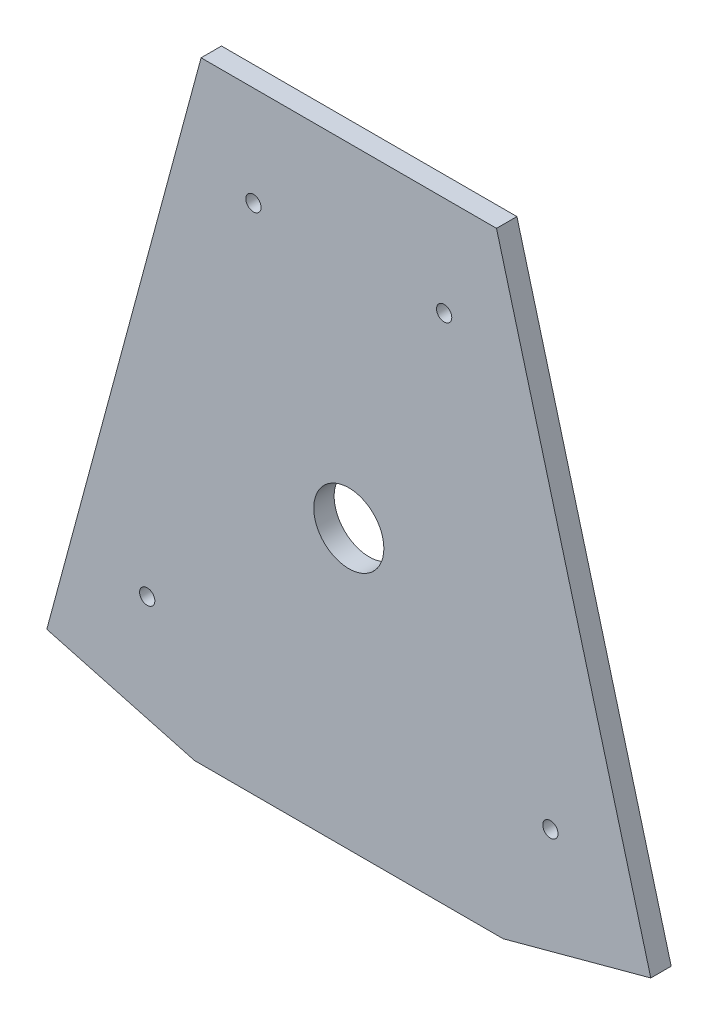
ISO-10303-21;
HEADER;
FILE_DESCRIPTION(('STEP AP214'),'2;1');
FILE_NAME('part.step','',(''),(''),'','','');
FILE_SCHEMA(('AUTOMOTIVE_DESIGN { 1 0 10303 214 1 1 1 1 }'));
ENDSEC;
DATA;
#1=APPLICATION_CONTEXT('core data for automotive mechanical design processes');
#2=APPLICATION_PROTOCOL_DEFINITION('international standard','automotive_design',2000,#1);
#3=PRODUCT_CONTEXT('',#1,'mechanical');
#4=PRODUCT('Part','Part','',(#3));
#5=PRODUCT_RELATED_PRODUCT_CATEGORY('part','',(#4));
#6=PRODUCT_DEFINITION_FORMATION('','',#4);
#7=PRODUCT_DEFINITION_CONTEXT('part definition',#1,'design');
#8=PRODUCT_DEFINITION('design','',#6,#7);
#9=PRODUCT_DEFINITION_SHAPE('','',#8);
#10=(LENGTH_UNIT() NAMED_UNIT(*) SI_UNIT(.MILLI.,.METRE.));
#11=(NAMED_UNIT(*) PLANE_ANGLE_UNIT() SI_UNIT($,.RADIAN.));
#12=(NAMED_UNIT(*) SI_UNIT($,.STERADIAN.) SOLID_ANGLE_UNIT());
#13=UNCERTAINTY_MEASURE_WITH_UNIT(LENGTH_MEASURE(1.E-05),#10,'distance_accuracy_value','');
#14=(GEOMETRIC_REPRESENTATION_CONTEXT(3) GLOBAL_UNCERTAINTY_ASSIGNED_CONTEXT((#13)) GLOBAL_UNIT_ASSIGNED_CONTEXT((#10,
#11,#12)) REPRESENTATION_CONTEXT('',''));
#15=CARTESIAN_POINT('',(0.,0.,0.));
#16=DIRECTION('',(0.,0.,1.));
#17=DIRECTION('',(1.,0.,0.));
#18=AXIS2_PLACEMENT_3D('',#15,#16,#17);
#19=CARTESIAN_POINT('',(-75.212399068759,-132.55771764791,5.08));
#20=DIRECTION('',(0.965501522964468,-0.260397406195401,0.));
#21=DIRECTION('',(0.260397406195401,0.965501522964468,0.));
#22=AXIS2_PLACEMENT_3D('',#19,#20,#21);
#23=PLANE('',#22);
#24=DIRECTION('',(-0.260397406195401,-0.965501522964468,0.));
#25=VECTOR('',#24,1.);
#26=CARTESIAN_POINT('',(-75.212399068759,-132.55771764791,0.));
#27=LINE('',#26,#25);
#28=CARTESIAN_POINT('',(-36.7856080249462,9.92114117604477,0.));
#29=VERTEX_POINT('',#28);
#30=CARTESIAN_POINT('',(-75.212399068759,-132.55771764791,0.));
#31=VERTEX_POINT('',#30);
#32=EDGE_CURVE('E118',#29,#31,#27,.T.);
#33=ORIENTED_EDGE('',*,*,#32,.T.);
#34=DIRECTION('',(0.,0.,-1.));
#35=VECTOR('',#34,1.);
#36=CARTESIAN_POINT('',(-75.212399068759,-132.55771764791,5.08));
#37=LINE('',#36,#35);
#38=CARTESIAN_POINT('',(-75.212399068759,-132.55771764791,5.08));
#39=VERTEX_POINT('',#38);
#40=EDGE_CURVE('E11',#39,#31,#37,.T.);
#41=ORIENTED_EDGE('',*,*,#40,.F.);
#42=DIRECTION('',(-0.260397406195401,-0.965501522964468,0.));
#43=VECTOR('',#42,1.);
#44=CARTESIAN_POINT('',(-75.212399068759,-132.55771764791,5.08));
#45=LINE('',#44,#43);
#46=CARTESIAN_POINT('',(-36.7856080249462,9.92114117604477,5.08));
#47=VERTEX_POINT('',#46);
#48=EDGE_CURVE('E129',#47,#39,#45,.T.);
#49=ORIENTED_EDGE('',*,*,#48,.F.);
#50=DIRECTION('',(0.,0.,-1.));
#51=VECTOR('',#50,1.);
#52=CARTESIAN_POINT('',(-36.7856080249462,9.92114117604477,5.08));
#53=LINE('',#52,#51);
#54=EDGE_CURVE('E114',#47,#29,#53,.T.);
#55=ORIENTED_EDGE('',*,*,#54,.T.);
#56=EDGE_LOOP('',(#33,#41,#49,#55));
#57=FACE_BOUND('',#56,.T.);
#58=ADVANCED_FACE('F33',(#57),#23,.F.);
#59=CARTESIAN_POINT('',(-38.4267910438128,-142.478858823955,5.08));
#60=DIRECTION('',(0.260397406195401,0.965501522964468,0.));
#61=DIRECTION('',(-0.965501522964468,0.260397406195401,0.));
#62=AXIS2_PLACEMENT_3D('',#59,#60,#61);
#63=PLANE('',#62);
#64=DIRECTION('',(0.965501522964468,-0.260397406195401,0.));
#65=VECTOR('',#64,1.);
#66=CARTESIAN_POINT('',(-38.4267910438128,-142.478858823955,0.));
#67=LINE('',#66,#65);
#68=CARTESIAN_POINT('',(-38.4267910438128,-142.478858823955,0.));
#69=VERTEX_POINT('',#68);
#70=EDGE_CURVE('E121',#31,#69,#67,.T.);
#71=ORIENTED_EDGE('',*,*,#70,.T.);
#72=DIRECTION('',(0.,0.,-1.));
#73=VECTOR('',#72,1.);
#74=CARTESIAN_POINT('',(-38.4267910438128,-142.478858823955,5.08));
#75=LINE('',#74,#73);
#76=CARTESIAN_POINT('',(-38.4267910438128,-142.478858823955,5.08));
#77=VERTEX_POINT('',#76);
#78=EDGE_CURVE('E41',#77,#69,#75,.T.);
#79=ORIENTED_EDGE('',*,*,#78,.F.);
#80=DIRECTION('',(0.965501522964468,-0.260397406195401,0.));
#81=VECTOR('',#80,1.);
#82=CARTESIAN_POINT('',(-38.4267910438128,-142.478858823955,5.08));
#83=LINE('',#82,#81);
#84=EDGE_CURVE('E86',#39,#77,#83,.T.);
#85=ORIENTED_EDGE('',*,*,#84,.F.);
#86=ORIENTED_EDGE('',*,*,#40,.T.);
#87=EDGE_LOOP('',(#71,#79,#85,#86));
#88=FACE_BOUND('',#87,.T.);
#89=ADVANCED_FACE('F155',(#88),#63,.F.);
#90=CARTESIAN_POINT('',(38.4267910438129,-142.478858823955,5.08));
#91=DIRECTION('',(0.,1.,0.));
#92=DIRECTION('',(-1.,0.,0.));
#93=AXIS2_PLACEMENT_3D('',#90,#91,#92);
#94=PLANE('',#93);
#95=DIRECTION('',(1.,0.,0.));
#96=VECTOR('',#95,1.);
#97=CARTESIAN_POINT('',(38.4267910438129,-142.478858823955,0.));
#98=LINE('',#97,#96);
#99=CARTESIAN_POINT('',(38.4267910438129,-142.478858823955,0.));
#100=VERTEX_POINT('',#99);
#101=EDGE_CURVE('E124',#69,#100,#98,.T.);
#102=ORIENTED_EDGE('',*,*,#101,.T.);
#103=DIRECTION('',(0.,0.,-1.));
#104=VECTOR('',#103,1.);
#105=CARTESIAN_POINT('',(38.4267910438129,-142.478858823955,5.08));
#106=LINE('',#105,#104);
#107=CARTESIAN_POINT('',(38.4267910438129,-142.478858823955,5.08));
#108=VERTEX_POINT('',#107);
#109=EDGE_CURVE('E109',#108,#100,#106,.T.);
#110=ORIENTED_EDGE('',*,*,#109,.F.);
#111=DIRECTION('',(1.,0.,0.));
#112=VECTOR('',#111,1.);
#113=CARTESIAN_POINT('',(38.4267910438129,-142.478858823955,5.08));
#114=LINE('',#113,#112);
#115=EDGE_CURVE('E100',#77,#108,#114,.T.);
#116=ORIENTED_EDGE('',*,*,#115,.F.);
#117=ORIENTED_EDGE('',*,*,#78,.T.);
#118=EDGE_LOOP('',(#102,#110,#116,#117));
#119=FACE_BOUND('',#118,.T.);
#120=ADVANCED_FACE('F135',(#119),#94,.F.);
#121=CARTESIAN_POINT('',(75.2123990687591,-132.55771764791,5.08));
#122=DIRECTION('',(-0.260397406195401,0.965501522964468,0.));
#123=DIRECTION('',(-0.965501522964468,-0.260397406195401,0.));
#124=AXIS2_PLACEMENT_3D('',#121,#122,#123);
#125=PLANE('',#124);
#126=DIRECTION('',(0.965501522964468,0.260397406195401,0.));
#127=VECTOR('',#126,1.);
#128=CARTESIAN_POINT('',(75.2123990687591,-132.55771764791,0.));
#129=LINE('',#128,#127);
#130=CARTESIAN_POINT('',(75.2123990687591,-132.55771764791,0.));
#131=VERTEX_POINT('',#130);
#132=EDGE_CURVE('E108',#100,#131,#129,.T.);
#133=ORIENTED_EDGE('',*,*,#132,.T.);
#134=DIRECTION('',(0.,0.,-1.));
#135=VECTOR('',#134,1.);
#136=CARTESIAN_POINT('',(75.2123990687591,-132.55771764791,5.08));
#137=LINE('',#136,#135);
#138=CARTESIAN_POINT('',(75.2123990687591,-132.55771764791,5.08));
#139=VERTEX_POINT('',#138);
#140=EDGE_CURVE('E105',#139,#131,#137,.T.);
#141=ORIENTED_EDGE('',*,*,#140,.F.);
#142=DIRECTION('',(0.965501522964468,0.260397406195401,0.));
#143=VECTOR('',#142,1.);
#144=CARTESIAN_POINT('',(75.2123990687591,-132.55771764791,5.08));
#145=LINE('',#144,#143);
#146=EDGE_CURVE('E93',#108,#139,#145,.T.);
#147=ORIENTED_EDGE('',*,*,#146,.F.);
#148=ORIENTED_EDGE('',*,*,#109,.T.);
#149=EDGE_LOOP('',(#133,#141,#147,#148));
#150=FACE_BOUND('',#149,.T.);
#151=ADVANCED_FACE('F106',(#150),#125,.F.);
#152=CARTESIAN_POINT('',(36.7856080249462,9.92114117604477,5.08));
#153=DIRECTION('',(-0.965501522964468,-0.260397406195401,0.));
#154=DIRECTION('',(0.260397406195401,-0.965501522964468,0.));
#155=AXIS2_PLACEMENT_3D('',#152,#153,#154);
#156=PLANE('',#155);
#157=DIRECTION('',(-0.260397406195401,0.965501522964468,0.));
#158=VECTOR('',#157,1.);
#159=CARTESIAN_POINT('',(36.7856080249462,9.92114117604477,0.));
#160=LINE('',#159,#158);
#161=CARTESIAN_POINT('',(36.7856080249462,9.92114117604477,0.));
#162=VERTEX_POINT('',#161);
#163=EDGE_CURVE('E72',#131,#162,#160,.T.);
#164=ORIENTED_EDGE('',*,*,#163,.T.);
#165=DIRECTION('',(0.,0.,-1.));
#166=VECTOR('',#165,1.);
#167=CARTESIAN_POINT('',(36.7856080249462,9.92114117604477,5.08));
#168=LINE('',#167,#166);
#169=CARTESIAN_POINT('',(36.7856080249462,9.92114117604477,5.08));
#170=VERTEX_POINT('',#169);
#171=EDGE_CURVE('E110',#170,#162,#168,.T.);
#172=ORIENTED_EDGE('',*,*,#171,.F.);
#173=DIRECTION('',(-0.260397406195401,0.965501522964468,0.));
#174=VECTOR('',#173,1.);
#175=CARTESIAN_POINT('',(36.7856080249462,9.92114117604477,5.08));
#176=LINE('',#175,#174);
#177=EDGE_CURVE('E98',#139,#170,#176,.T.);
#178=ORIENTED_EDGE('',*,*,#177,.F.);
#179=ORIENTED_EDGE('',*,*,#140,.T.);
#180=EDGE_LOOP('',(#164,#172,#178,#179));
#181=FACE_BOUND('',#180,.T.);
#182=ADVANCED_FACE('F112',(#181),#156,.F.);
#183=CARTESIAN_POINT('',(-36.7856080249462,9.92114117604477,5.08));
#184=DIRECTION('',(0.,-1.,0.));
#185=DIRECTION('',(0.,0.,-1.));
#186=AXIS2_PLACEMENT_3D('',#183,#184,#185);
#187=PLANE('',#186);
#188=DIRECTION('',(-1.,0.,0.));
#189=VECTOR('',#188,1.);
#190=CARTESIAN_POINT('',(-36.7856080249462,9.92114117604477,0.));
#191=LINE('',#190,#189);
#192=EDGE_CURVE('E78',#162,#29,#191,.T.);
#193=ORIENTED_EDGE('',*,*,#192,.T.);
#194=ORIENTED_EDGE('',*,*,#54,.F.);
#195=DIRECTION('',(-1.,0.,0.));
#196=VECTOR('',#195,1.);
#197=CARTESIAN_POINT('',(-36.7856080249462,9.92114117604477,5.08));
#198=LINE('',#197,#196);
#199=EDGE_CURVE('E49',#170,#47,#198,.T.);
#200=ORIENTED_EDGE('',*,*,#199,.F.);
#201=ORIENTED_EDGE('',*,*,#171,.T.);
#202=EDGE_LOOP('',(#193,#194,#200,#201));
#203=FACE_BOUND('',#202,.T.);
#204=ADVANCED_FACE('F143',(#203),#187,.F.);
#205=CARTESIAN_POINT('',(0.,0.,5.08));
#206=DIRECTION('',(0.,0.,1.));
#207=DIRECTION('',(1.,0.,0.));
#208=AXIS2_PLACEMENT_3D('',#205,#206,#207);
#209=PLANE('',#208);
#210=CARTESIAN_POINT('',(-50.2055009389227,-112.994549552635,5.08));
#211=DIRECTION('',(0.,0.,1.));
#212=DIRECTION('',(1.,0.,0.));
#213=AXIS2_PLACEMENT_3D('',#210,#211,#212);
#214=CIRCLE('',#213,1.89864999999999);
#215=CARTESIAN_POINT('',(-48.3068509389228,-112.994549552635,5.08));
#216=VERTEX_POINT('',#215);
#217=EDGE_CURVE('E259',#216,#216,#214,.T.);
#218=ORIENTED_EDGE('',*,*,#217,.F.);
#219=EDGE_LOOP('',(#218));
#220=FACE_BOUND('',#219,.T.);
#221=CARTESIAN_POINT('',(-23.74912446947,-14.8995948194454,5.08));
#222=DIRECTION('',(0.,0.,1.));
#223=DIRECTION('',(1.,0.,0.));
#224=AXIS2_PLACEMENT_3D('',#221,#222,#223);
#225=CIRCLE('',#224,1.89864999999999);
#226=CARTESIAN_POINT('',(-21.8504744694701,-14.8995948194454,5.08));
#227=VERTEX_POINT('',#226);
#228=EDGE_CURVE('E267',#227,#227,#225,.T.);
#229=ORIENTED_EDGE('',*,*,#228,.F.);
#230=EDGE_LOOP('',(#229));
#231=FACE_BOUND('',#230,.T.);
#232=CARTESIAN_POINT('',(23.74912446947,-14.8995948194454,5.08));
#233=DIRECTION('',(0.,0.,1.));
#234=DIRECTION('',(1.,0.,0.));
#235=AXIS2_PLACEMENT_3D('',#232,#233,#234);
#236=CIRCLE('',#235,1.89864999999999);
#237=CARTESIAN_POINT('',(25.64777446947,-14.8995948194454,5.08));
#238=VERTEX_POINT('',#237);
#239=EDGE_CURVE('E273',#238,#238,#236,.T.);
#240=ORIENTED_EDGE('',*,*,#239,.F.);
#241=EDGE_LOOP('',(#240));
#242=FACE_BOUND('',#241,.T.);
#243=CARTESIAN_POINT('',(50.2055009389228,-112.994549552635,5.08));
#244=DIRECTION('',(0.,0.,1.));
#245=DIRECTION('',(1.,0.,0.));
#246=AXIS2_PLACEMENT_3D('',#243,#244,#245);
#247=CIRCLE('',#246,1.89864999999999);
#248=CARTESIAN_POINT('',(52.1041509389227,-112.994549552635,5.08));
#249=VERTEX_POINT('',#248);
#250=EDGE_CURVE('E279',#249,#249,#247,.T.);
#251=ORIENTED_EDGE('',*,*,#250,.F.);
#252=EDGE_LOOP('',(#251));
#253=FACE_BOUND('',#252,.T.);
#254=ORIENTED_EDGE('',*,*,#48,.T.);
#255=ORIENTED_EDGE('',*,*,#84,.T.);
#256=ORIENTED_EDGE('',*,*,#115,.T.);
#257=ORIENTED_EDGE('',*,*,#146,.T.);
#258=ORIENTED_EDGE('',*,*,#177,.T.);
#259=ORIENTED_EDGE('',*,*,#199,.T.);
#260=EDGE_LOOP('',(#254,#255,#256,#257,#258,#259));
#261=FACE_BOUND('',#260,.T.);
#262=CARTESIAN_POINT('',(0.,-73.1574107374364,5.08));
#263=DIRECTION('',(0.,0.,1.));
#264=DIRECTION('',(1.,0.,0.));
#265=AXIS2_PLACEMENT_3D('',#262,#263,#264);
#266=CIRCLE('',#265,8.73125);
#267=CARTESIAN_POINT('',(8.73125,-73.1574107374364,5.08));
#268=VERTEX_POINT('',#267);
#269=EDGE_CURVE('E257',#268,#268,#266,.T.);
#270=ORIENTED_EDGE('',*,*,#269,.F.);
#271=EDGE_LOOP('',(#270));
#272=FACE_BOUND('',#271,.T.);
#273=ADVANCED_FACE('F95',(#220,#231,#242,#253,#261,#272),#209,.T.);
#274=CARTESIAN_POINT('',(0.,0.,0.));
#275=DIRECTION('',(0.,0.,1.));
#276=DIRECTION('',(1.,0.,0.));
#277=AXIS2_PLACEMENT_3D('',#274,#275,#276);
#278=PLANE('',#277);
#279=CARTESIAN_POINT('',(-50.2055009389227,-112.994549552635,0.));
#280=DIRECTION('',(0.,0.,1.));
#281=DIRECTION('',(1.,0.,0.));
#282=AXIS2_PLACEMENT_3D('',#279,#280,#281);
#283=CIRCLE('',#282,1.89864999999999);
#284=CARTESIAN_POINT('',(-48.3068509389228,-112.994549552635,0.));
#285=VERTEX_POINT('',#284);
#286=EDGE_CURVE('E264',#285,#285,#283,.T.);
#287=ORIENTED_EDGE('',*,*,#286,.T.);
#288=EDGE_LOOP('',(#287));
#289=FACE_BOUND('',#288,.T.);
#290=CARTESIAN_POINT('',(-23.74912446947,-14.8995948194454,0.));
#291=DIRECTION('',(0.,0.,1.));
#292=DIRECTION('',(1.,0.,0.));
#293=AXIS2_PLACEMENT_3D('',#290,#291,#292);
#294=CIRCLE('',#293,1.89865);
#295=CARTESIAN_POINT('',(-21.85047446947,-14.8995948194454,0.));
#296=VERTEX_POINT('',#295);
#297=EDGE_CURVE('E270',#296,#296,#294,.T.);
#298=ORIENTED_EDGE('',*,*,#297,.T.);
#299=EDGE_LOOP('',(#298));
#300=FACE_BOUND('',#299,.T.);
#301=CARTESIAN_POINT('',(23.74912446947,-14.8995948194454,0.));
#302=DIRECTION('',(0.,0.,1.));
#303=DIRECTION('',(1.,0.,0.));
#304=AXIS2_PLACEMENT_3D('',#301,#302,#303);
#305=CIRCLE('',#304,1.89865);
#306=CARTESIAN_POINT('',(25.64777446947,-14.8995948194454,0.));
#307=VERTEX_POINT('',#306);
#308=EDGE_CURVE('E276',#307,#307,#305,.T.);
#309=ORIENTED_EDGE('',*,*,#308,.T.);
#310=EDGE_LOOP('',(#309));
#311=FACE_BOUND('',#310,.T.);
#312=CARTESIAN_POINT('',(50.2055009389228,-112.994549552635,0.));
#313=DIRECTION('',(0.,0.,1.));
#314=DIRECTION('',(1.,0.,0.));
#315=AXIS2_PLACEMENT_3D('',#312,#313,#314);
#316=CIRCLE('',#315,1.89864999999999);
#317=CARTESIAN_POINT('',(52.1041509389228,-112.994549552635,0.));
#318=VERTEX_POINT('',#317);
#319=EDGE_CURVE('E122',#318,#318,#316,.T.);
#320=ORIENTED_EDGE('',*,*,#319,.T.);
#321=EDGE_LOOP('',(#320));
#322=FACE_BOUND('',#321,.T.);
#323=ORIENTED_EDGE('',*,*,#32,.F.);
#324=ORIENTED_EDGE('',*,*,#192,.F.);
#325=ORIENTED_EDGE('',*,*,#163,.F.);
#326=ORIENTED_EDGE('',*,*,#132,.F.);
#327=ORIENTED_EDGE('',*,*,#101,.F.);
#328=ORIENTED_EDGE('',*,*,#70,.F.);
#329=EDGE_LOOP('',(#323,#324,#325,#326,#327,#328));
#330=FACE_BOUND('',#329,.T.);
#331=CARTESIAN_POINT('',(0.,-73.1574107374364,0.));
#332=DIRECTION('',(0.,0.,1.));
#333=DIRECTION('',(1.,0.,0.));
#334=AXIS2_PLACEMENT_3D('',#331,#332,#333);
#335=CIRCLE('',#334,8.73125);
#336=CARTESIAN_POINT('',(8.73125,-73.1574107374364,0.));
#337=VERTEX_POINT('',#336);
#338=EDGE_CURVE('E254',#337,#337,#335,.F.);
#339=ORIENTED_EDGE('',*,*,#338,.F.);
#340=EDGE_LOOP('',(#339));
#341=FACE_BOUND('',#340,.T.);
#342=ADVANCED_FACE('F138',(#289,#300,#311,#322,#330,#341),#278,.F.);
#343=CARTESIAN_POINT('',(50.2055009389228,-112.994549552635,5.08));
#344=DIRECTION('',(0.,0.,1.));
#345=DIRECTION('',(1.,0.,0.));
#346=AXIS2_PLACEMENT_3D('',#343,#344,#345);
#347=CYLINDRICAL_SURFACE('',#346,1.89864999999999);
#348=ORIENTED_EDGE('',*,*,#319,.F.);
#349=EDGE_LOOP('',(#348));
#350=FACE_BOUND('',#349,.T.);
#351=ORIENTED_EDGE('',*,*,#250,.T.);
#352=EDGE_LOOP('',(#351));
#353=FACE_BOUND('',#352,.T.);
#354=ADVANCED_FACE('F183',(#350,#353),#347,.F.);
#355=CARTESIAN_POINT('',(23.74912446947,-14.8995948194454,5.08));
#356=DIRECTION('',(0.,0.,1.));
#357=DIRECTION('',(1.,0.,0.));
#358=AXIS2_PLACEMENT_3D('',#355,#356,#357);
#359=CYLINDRICAL_SURFACE('',#358,1.89864999999999);
#360=ORIENTED_EDGE('',*,*,#308,.F.);
#361=EDGE_LOOP('',(#360));
#362=FACE_BOUND('',#361,.T.);
#363=ORIENTED_EDGE('',*,*,#239,.T.);
#364=EDGE_LOOP('',(#363));
#365=FACE_BOUND('',#364,.T.);
#366=ADVANCED_FACE('F188',(#362,#365),#359,.F.);
#367=CARTESIAN_POINT('',(-23.74912446947,-14.8995948194454,5.08));
#368=DIRECTION('',(0.,0.,1.));
#369=DIRECTION('',(1.,0.,0.));
#370=AXIS2_PLACEMENT_3D('',#367,#368,#369);
#371=CYLINDRICAL_SURFACE('',#370,1.89864999999999);
#372=ORIENTED_EDGE('',*,*,#297,.F.);
#373=EDGE_LOOP('',(#372));
#374=FACE_BOUND('',#373,.T.);
#375=ORIENTED_EDGE('',*,*,#228,.T.);
#376=EDGE_LOOP('',(#375));
#377=FACE_BOUND('',#376,.T.);
#378=ADVANCED_FACE('F200',(#374,#377),#371,.F.);
#379=CARTESIAN_POINT('',(-50.2055009389227,-112.994549552635,5.08));
#380=DIRECTION('',(0.,0.,1.));
#381=DIRECTION('',(1.,0.,0.));
#382=AXIS2_PLACEMENT_3D('',#379,#380,#381);
#383=CYLINDRICAL_SURFACE('',#382,1.89864999999999);
#384=ORIENTED_EDGE('',*,*,#286,.F.);
#385=EDGE_LOOP('',(#384));
#386=FACE_BOUND('',#385,.T.);
#387=ORIENTED_EDGE('',*,*,#217,.T.);
#388=EDGE_LOOP('',(#387));
#389=FACE_BOUND('',#388,.T.);
#390=ADVANCED_FACE('F210',(#386,#389),#383,.F.);
#391=CARTESIAN_POINT('',(0.,-73.1574107374364,-53.8815367264149));
#392=DIRECTION('',(0.,0.,1.));
#393=DIRECTION('',(1.,0.,0.));
#394=AXIS2_PLACEMENT_3D('',#391,#392,#393);
#395=CYLINDRICAL_SURFACE('',#394,8.73125);
#396=ORIENTED_EDGE('',*,*,#338,.T.);
#397=EDGE_LOOP('',(#396));
#398=FACE_BOUND('',#397,.T.);
#399=ORIENTED_EDGE('',*,*,#269,.T.);
#400=EDGE_LOOP('',(#399));
#401=FACE_BOUND('',#400,.T.);
#402=ADVANCED_FACE('F220',(#398,#401),#395,.F.);
#403=CLOSED_SHELL('',(#58,#89,#120,#151,#182,#204,#273,#342,#354,#366,#378,#390,#402));
#404=MANIFOLD_SOLID_BREP('B2',#403);
#405=ADVANCED_BREP_SHAPE_REPRESENTATION('',(#18,#404),#14);
#406=SHAPE_DEFINITION_REPRESENTATION(#9,#405);
ENDSEC;
END-ISO-10303-21;
